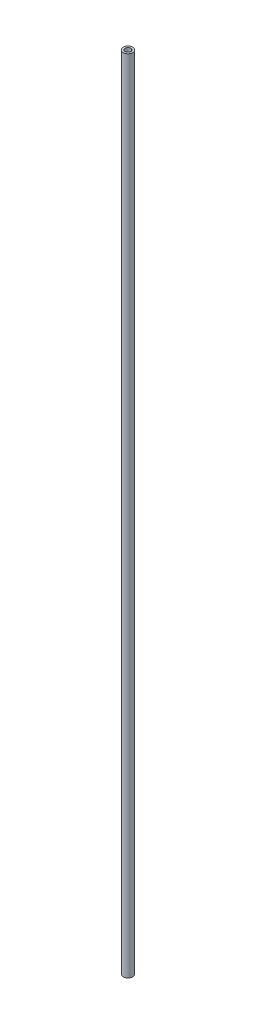
ISO-10303-21;
HEADER;
FILE_DESCRIPTION(('STEP AP214'),'2;1');
FILE_NAME('part.step','',(''),(''),'','','');
FILE_SCHEMA(('AUTOMOTIVE_DESIGN { 1 0 10303 214 1 1 1 1 }'));
ENDSEC;
DATA;
#1=APPLICATION_CONTEXT('core data for automotive mechanical design processes');
#2=APPLICATION_PROTOCOL_DEFINITION('international standard','automotive_design',2000,#1);
#3=PRODUCT_CONTEXT('',#1,'mechanical');
#4=PRODUCT('Part','Part','',(#3));
#5=PRODUCT_RELATED_PRODUCT_CATEGORY('part','',(#4));
#6=PRODUCT_DEFINITION_FORMATION('','',#4);
#7=PRODUCT_DEFINITION_CONTEXT('part definition',#1,'design');
#8=PRODUCT_DEFINITION('design','',#6,#7);
#9=PRODUCT_DEFINITION_SHAPE('','',#8);
#10=(LENGTH_UNIT() NAMED_UNIT(*) SI_UNIT(.MILLI.,.METRE.));
#11=(NAMED_UNIT(*) PLANE_ANGLE_UNIT() SI_UNIT($,.RADIAN.));
#12=(NAMED_UNIT(*) SI_UNIT($,.STERADIAN.) SOLID_ANGLE_UNIT());
#13=UNCERTAINTY_MEASURE_WITH_UNIT(LENGTH_MEASURE(1.E-05),#10,'distance_accuracy_value','');
#14=(GEOMETRIC_REPRESENTATION_CONTEXT(3) GLOBAL_UNCERTAINTY_ASSIGNED_CONTEXT((#13)) GLOBAL_UNIT_ASSIGNED_CONTEXT((#10,
#11,#12)) REPRESENTATION_CONTEXT('',''));
#15=CARTESIAN_POINT('',(0.,0.,0.));
#16=DIRECTION('',(0.,0.,1.));
#17=DIRECTION('',(1.,0.,0.));
#18=AXIS2_PLACEMENT_3D('',#15,#16,#17);
#19=CARTESIAN_POINT('',(0.,209.5,0.));
#20=DIRECTION('',(0.,1.,0.));
#21=DIRECTION('',(0.,0.,1.));
#22=AXIS2_PLACEMENT_3D('',#19,#20,#21);
#23=PLANE('',#22);
#24=CARTESIAN_POINT('',(0.,209.5,0.));
#25=DIRECTION('',(0.,1.,0.));
#26=DIRECTION('',(0.,0.,1.));
#27=AXIS2_PLACEMENT_3D('',#24,#25,#26);
#28=CIRCLE('',#27,2.5);
#29=CARTESIAN_POINT('',(0.,209.5,2.5));
#30=VERTEX_POINT('',#29);
#31=EDGE_CURVE('E11',#30,#30,#28,.T.);
#32=ORIENTED_EDGE('',*,*,#31,.T.);
#33=EDGE_LOOP('',(#32));
#34=FACE_BOUND('',#33,.T.);
#35=CARTESIAN_POINT('',(0.,209.5,0.));
#36=DIRECTION('',(0.,1.,0.));
#37=DIRECTION('',(0.,0.,1.));
#38=AXIS2_PLACEMENT_3D('',#35,#36,#37);
#39=CIRCLE('',#38,1.5);
#40=CARTESIAN_POINT('',(0.,209.5,1.5));
#41=VERTEX_POINT('',#40);
#42=EDGE_CURVE('E58',#41,#41,#39,.T.);
#43=ORIENTED_EDGE('',*,*,#42,.F.);
#44=EDGE_LOOP('',(#43));
#45=FACE_BOUND('',#44,.T.);
#46=ADVANCED_FACE('F45',(#34,#45),#23,.T.);
#47=CARTESIAN_POINT('',(0.,-209.5,0.));
#48=DIRECTION('',(0.,1.,0.));
#49=DIRECTION('',(0.,0.,1.));
#50=AXIS2_PLACEMENT_3D('',#47,#48,#49);
#51=PLANE('',#50);
#52=CARTESIAN_POINT('',(0.,-209.5,0.));
#53=DIRECTION('',(0.,1.,0.));
#54=DIRECTION('',(0.,0.,1.));
#55=AXIS2_PLACEMENT_3D('',#52,#53,#54);
#56=CIRCLE('',#55,2.5);
#57=CARTESIAN_POINT('',(0.,-209.5,2.5));
#58=VERTEX_POINT('',#57);
#59=EDGE_CURVE('E49',#58,#58,#56,.T.);
#60=ORIENTED_EDGE('',*,*,#59,.F.);
#61=EDGE_LOOP('',(#60));
#62=FACE_BOUND('',#61,.T.);
#63=CARTESIAN_POINT('',(0.,-209.5,0.));
#64=DIRECTION('',(0.,1.,0.));
#65=DIRECTION('',(0.,0.,1.));
#66=AXIS2_PLACEMENT_3D('',#63,#64,#65);
#67=CIRCLE('',#66,1.5);
#68=CARTESIAN_POINT('',(0.,-209.5,1.5));
#69=VERTEX_POINT('',#68);
#70=EDGE_CURVE('E60',#69,#69,#67,.T.);
#71=ORIENTED_EDGE('',*,*,#70,.T.);
#72=EDGE_LOOP('',(#71));
#73=FACE_BOUND('',#72,.T.);
#74=ADVANCED_FACE('F72',(#62,#73),#51,.F.);
#75=CARTESIAN_POINT('',(0.,209.5,0.));
#76=DIRECTION('',(0.,-1.,0.));
#77=DIRECTION('',(0.,0.,-1.));
#78=AXIS2_PLACEMENT_3D('',#75,#76,#77);
#79=CYLINDRICAL_SURFACE('',#78,2.5);
#80=ORIENTED_EDGE('',*,*,#31,.F.);
#81=EDGE_LOOP('',(#80));
#82=FACE_BOUND('',#81,.T.);
#83=ORIENTED_EDGE('',*,*,#59,.T.);
#84=EDGE_LOOP('',(#83));
#85=FACE_BOUND('',#84,.T.);
#86=ADVANCED_FACE('F47',(#82,#85),#79,.T.);
#87=CARTESIAN_POINT('',(0.,209.5,0.));
#88=DIRECTION('',(0.,-1.,0.));
#89=DIRECTION('',(0.,0.,-1.));
#90=AXIS2_PLACEMENT_3D('',#87,#88,#89);
#91=CYLINDRICAL_SURFACE('',#90,1.5);
#92=ORIENTED_EDGE('',*,*,#42,.T.);
#93=EDGE_LOOP('',(#92));
#94=FACE_BOUND('',#93,.T.);
#95=ORIENTED_EDGE('',*,*,#70,.F.);
#96=EDGE_LOOP('',(#95));
#97=FACE_BOUND('',#96,.T.);
#98=ADVANCED_FACE('F68',(#94,#97),#91,.F.);
#99=CLOSED_SHELL('',(#46,#74,#86,#98));
#100=MANIFOLD_SOLID_BREP('B2',#99);
#101=ADVANCED_BREP_SHAPE_REPRESENTATION('',(#18,#100),#14);
#102=SHAPE_DEFINITION_REPRESENTATION(#9,#101);
ENDSEC;
END-ISO-10303-21;
